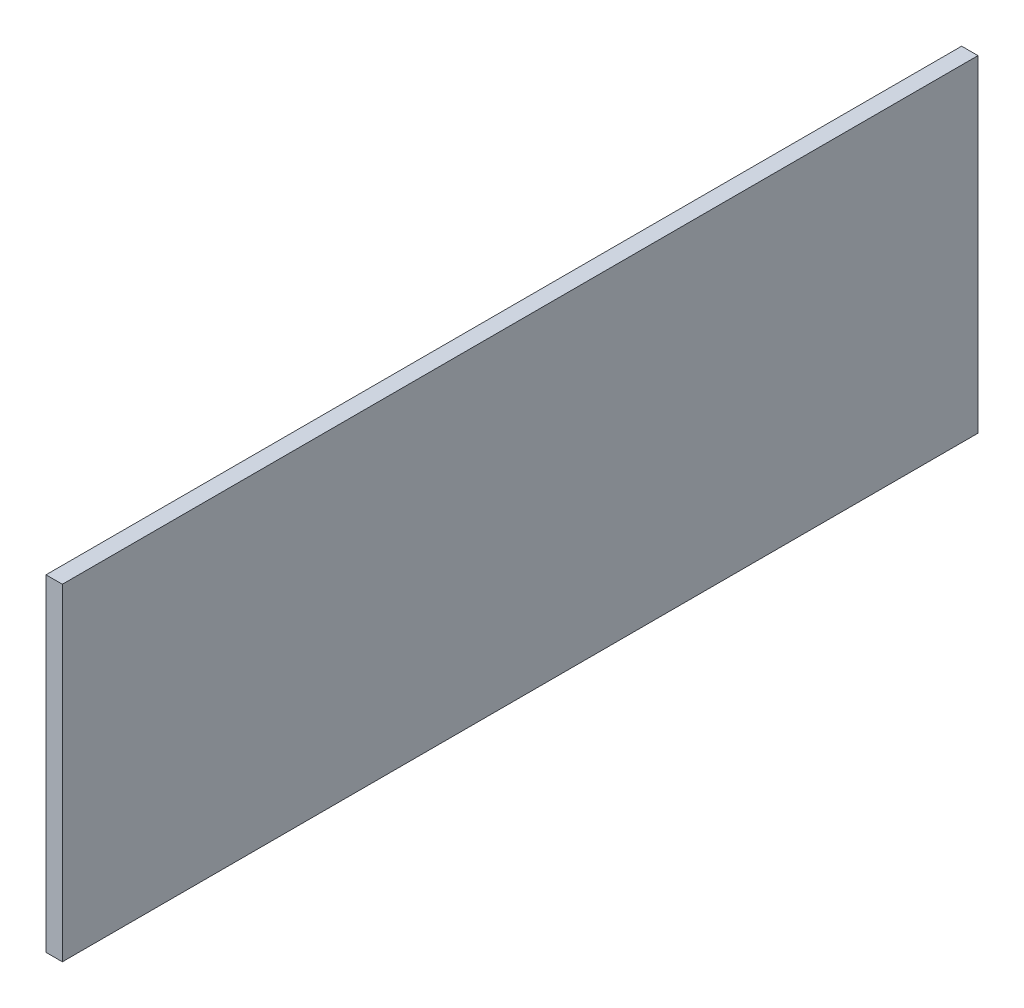
ISO-10303-21;
HEADER;
FILE_DESCRIPTION(('STEP AP214'),'2;1');
FILE_NAME('part.step','',(''),(''),'','','');
FILE_SCHEMA(('AUTOMOTIVE_DESIGN { 1 0 10303 214 1 1 1 1 }'));
ENDSEC;
DATA;
#1=APPLICATION_CONTEXT('core data for automotive mechanical design processes');
#2=APPLICATION_PROTOCOL_DEFINITION('international standard','automotive_design',2000,#1);
#3=PRODUCT_CONTEXT('',#1,'mechanical');
#4=PRODUCT('Part','Part','',(#3));
#5=PRODUCT_RELATED_PRODUCT_CATEGORY('part','',(#4));
#6=PRODUCT_DEFINITION_FORMATION('','',#4);
#7=PRODUCT_DEFINITION_CONTEXT('part definition',#1,'design');
#8=PRODUCT_DEFINITION('design','',#6,#7);
#9=PRODUCT_DEFINITION_SHAPE('','',#8);
#10=(LENGTH_UNIT() NAMED_UNIT(*) SI_UNIT(.MILLI.,.METRE.));
#11=(NAMED_UNIT(*) PLANE_ANGLE_UNIT() SI_UNIT($,.RADIAN.));
#12=(NAMED_UNIT(*) SI_UNIT($,.STERADIAN.) SOLID_ANGLE_UNIT());
#13=UNCERTAINTY_MEASURE_WITH_UNIT(LENGTH_MEASURE(1.E-05),#10,'distance_accuracy_value','');
#14=(GEOMETRIC_REPRESENTATION_CONTEXT(3) GLOBAL_UNCERTAINTY_ASSIGNED_CONTEXT((#13)) GLOBAL_UNIT_ASSIGNED_CONTEXT((#10,
#11,#12)) REPRESENTATION_CONTEXT('',''));
#15=CARTESIAN_POINT('',(0.,0.,0.));
#16=DIRECTION('',(0.,0.,1.));
#17=DIRECTION('',(1.,0.,0.));
#18=AXIS2_PLACEMENT_3D('',#15,#16,#17);
#19=CARTESIAN_POINT('',(0.79375,-15.875,-44.45));
#20=DIRECTION('',(0.,0.,1.));
#21=DIRECTION('',(1.,0.,0.));
#22=AXIS2_PLACEMENT_3D('',#19,#20,#21);
#23=PLANE('',#22);
#24=DIRECTION('',(0.,1.,0.));
#25=VECTOR('',#24,1.);
#26=CARTESIAN_POINT('',(-0.79375,-15.875,-44.45));
#27=LINE('',#26,#25);
#28=CARTESIAN_POINT('',(-0.79375,-15.875,-44.45));
#29=VERTEX_POINT('',#28);
#30=CARTESIAN_POINT('',(-0.79375,15.875,-44.45));
#31=VERTEX_POINT('',#30);
#32=EDGE_CURVE('E94',#29,#31,#27,.T.);
#33=ORIENTED_EDGE('',*,*,#32,.T.);
#34=DIRECTION('',(-1.,0.,0.));
#35=VECTOR('',#34,1.);
#36=CARTESIAN_POINT('',(0.79375,15.875,-44.45));
#37=LINE('',#36,#35);
#38=CARTESIAN_POINT('',(0.79375,15.875,-44.45));
#39=VERTEX_POINT('',#38);
#40=EDGE_CURVE('E11',#39,#31,#37,.T.);
#41=ORIENTED_EDGE('',*,*,#40,.F.);
#42=DIRECTION('',(0.,1.,0.));
#43=VECTOR('',#42,1.);
#44=CARTESIAN_POINT('',(0.79375,-15.875,-44.45));
#45=LINE('',#44,#43);
#46=CARTESIAN_POINT('',(0.79375,-15.875,-44.45));
#47=VERTEX_POINT('',#46);
#48=EDGE_CURVE('E82',#47,#39,#45,.T.);
#49=ORIENTED_EDGE('',*,*,#48,.F.);
#50=DIRECTION('',(-1.,0.,0.));
#51=VECTOR('',#50,1.);
#52=CARTESIAN_POINT('',(0.79375,-15.875,-44.45));
#53=LINE('',#52,#51);
#54=EDGE_CURVE('E90',#47,#29,#53,.T.);
#55=ORIENTED_EDGE('',*,*,#54,.T.);
#56=EDGE_LOOP('',(#33,#41,#49,#55));
#57=FACE_BOUND('',#56,.T.);
#58=ADVANCED_FACE('F31',(#57),#23,.F.);
#59=CARTESIAN_POINT('',(0.79375,15.875,44.45));
#60=DIRECTION('',(0.,-1.,0.));
#61=DIRECTION('',(0.,0.,-1.));
#62=AXIS2_PLACEMENT_3D('',#59,#60,#61);
#63=PLANE('',#62);
#64=DIRECTION('',(0.,0.,1.));
#65=VECTOR('',#64,1.);
#66=CARTESIAN_POINT('',(-0.79375,15.875,44.45));
#67=LINE('',#66,#65);
#68=CARTESIAN_POINT('',(-0.79375,15.875,44.45));
#69=VERTEX_POINT('',#68);
#70=EDGE_CURVE('E86',#31,#69,#67,.T.);
#71=ORIENTED_EDGE('',*,*,#70,.T.);
#72=DIRECTION('',(-1.,0.,0.));
#73=VECTOR('',#72,1.);
#74=CARTESIAN_POINT('',(0.79375,15.875,44.45));
#75=LINE('',#74,#73);
#76=CARTESIAN_POINT('',(0.79375,15.875,44.45));
#77=VERTEX_POINT('',#76);
#78=EDGE_CURVE('E39',#77,#69,#75,.T.);
#79=ORIENTED_EDGE('',*,*,#78,.F.);
#80=DIRECTION('',(0.,0.,1.));
#81=VECTOR('',#80,1.);
#82=CARTESIAN_POINT('',(0.79375,15.875,44.45));
#83=LINE('',#82,#81);
#84=EDGE_CURVE('E77',#39,#77,#83,.T.);
#85=ORIENTED_EDGE('',*,*,#84,.F.);
#86=ORIENTED_EDGE('',*,*,#40,.T.);
#87=EDGE_LOOP('',(#71,#79,#85,#86));
#88=FACE_BOUND('',#87,.T.);
#89=ADVANCED_FACE('F85',(#88),#63,.F.);
#90=CARTESIAN_POINT('',(0.79375,-15.875,44.45));
#91=DIRECTION('',(0.,0.,-1.));
#92=DIRECTION('',(-1.,0.,0.));
#93=AXIS2_PLACEMENT_3D('',#90,#91,#92);
#94=PLANE('',#93);
#95=DIRECTION('',(0.,-1.,0.));
#96=VECTOR('',#95,1.);
#97=CARTESIAN_POINT('',(-0.79375,-15.875,44.45));
#98=LINE('',#97,#96);
#99=CARTESIAN_POINT('',(-0.79375,-15.875,44.45));
#100=VERTEX_POINT('',#99);
#101=EDGE_CURVE('E64',#69,#100,#98,.T.);
#102=ORIENTED_EDGE('',*,*,#101,.T.);
#103=DIRECTION('',(-1.,0.,0.));
#104=VECTOR('',#103,1.);
#105=CARTESIAN_POINT('',(0.79375,-15.875,44.45));
#106=LINE('',#105,#104);
#107=CARTESIAN_POINT('',(0.79375,-15.875,44.45));
#108=VERTEX_POINT('',#107);
#109=EDGE_CURVE('E87',#108,#100,#106,.T.);
#110=ORIENTED_EDGE('',*,*,#109,.F.);
#111=DIRECTION('',(0.,-1.,0.));
#112=VECTOR('',#111,1.);
#113=CARTESIAN_POINT('',(0.79375,-15.875,44.45));
#114=LINE('',#113,#112);
#115=EDGE_CURVE('E80',#77,#108,#114,.T.);
#116=ORIENTED_EDGE('',*,*,#115,.F.);
#117=ORIENTED_EDGE('',*,*,#78,.T.);
#118=EDGE_LOOP('',(#102,#110,#116,#117));
#119=FACE_BOUND('',#118,.T.);
#120=ADVANCED_FACE('F88',(#119),#94,.F.);
#121=CARTESIAN_POINT('',(0.79375,-15.875,44.45));
#122=DIRECTION('',(0.,1.,0.));
#123=DIRECTION('',(0.,0.,1.));
#124=AXIS2_PLACEMENT_3D('',#121,#122,#123);
#125=PLANE('',#124);
#126=DIRECTION('',(0.,0.,-1.));
#127=VECTOR('',#126,1.);
#128=CARTESIAN_POINT('',(-0.79375,-15.875,44.45));
#129=LINE('',#128,#127);
#130=EDGE_CURVE('E70',#100,#29,#129,.T.);
#131=ORIENTED_EDGE('',*,*,#130,.T.);
#132=ORIENTED_EDGE('',*,*,#54,.F.);
#133=DIRECTION('',(0.,0.,-1.));
#134=VECTOR('',#133,1.);
#135=CARTESIAN_POINT('',(0.79375,-15.875,44.45));
#136=LINE('',#135,#134);
#137=EDGE_CURVE('E47',#108,#47,#136,.T.);
#138=ORIENTED_EDGE('',*,*,#137,.F.);
#139=ORIENTED_EDGE('',*,*,#109,.T.);
#140=EDGE_LOOP('',(#131,#132,#138,#139));
#141=FACE_BOUND('',#140,.T.);
#142=ADVANCED_FACE('F101',(#141),#125,.F.);
#143=CARTESIAN_POINT('',(0.79375,15.875,-44.45));
#144=DIRECTION('',(-1.,0.,0.));
#145=DIRECTION('',(0.,0.,1.));
#146=AXIS2_PLACEMENT_3D('',#143,#144,#145);
#147=PLANE('',#146);
#148=ORIENTED_EDGE('',*,*,#48,.T.);
#149=ORIENTED_EDGE('',*,*,#84,.T.);
#150=ORIENTED_EDGE('',*,*,#115,.T.);
#151=ORIENTED_EDGE('',*,*,#137,.T.);
#152=EDGE_LOOP('',(#148,#149,#150,#151));
#153=FACE_BOUND('',#152,.T.);
#154=ADVANCED_FACE('F78',(#153),#147,.F.);
#155=CARTESIAN_POINT('',(-0.79375,15.875,-44.45));
#156=DIRECTION('',(-1.,0.,0.));
#157=DIRECTION('',(0.,0.,1.));
#158=AXIS2_PLACEMENT_3D('',#155,#156,#157);
#159=PLANE('',#158);
#160=ORIENTED_EDGE('',*,*,#32,.F.);
#161=ORIENTED_EDGE('',*,*,#130,.F.);
#162=ORIENTED_EDGE('',*,*,#101,.F.);
#163=ORIENTED_EDGE('',*,*,#70,.F.);
#164=EDGE_LOOP('',(#160,#161,#162,#163));
#165=FACE_BOUND('',#164,.T.);
#166=ADVANCED_FACE('F104',(#165),#159,.T.);
#167=CLOSED_SHELL('',(#58,#89,#120,#142,#154,#166));
#168=MANIFOLD_SOLID_BREP('B2',#167);
#169=ADVANCED_BREP_SHAPE_REPRESENTATION('',(#18,#168),#14);
#170=SHAPE_DEFINITION_REPRESENTATION(#9,#169);
ENDSEC;
END-ISO-10303-21;
